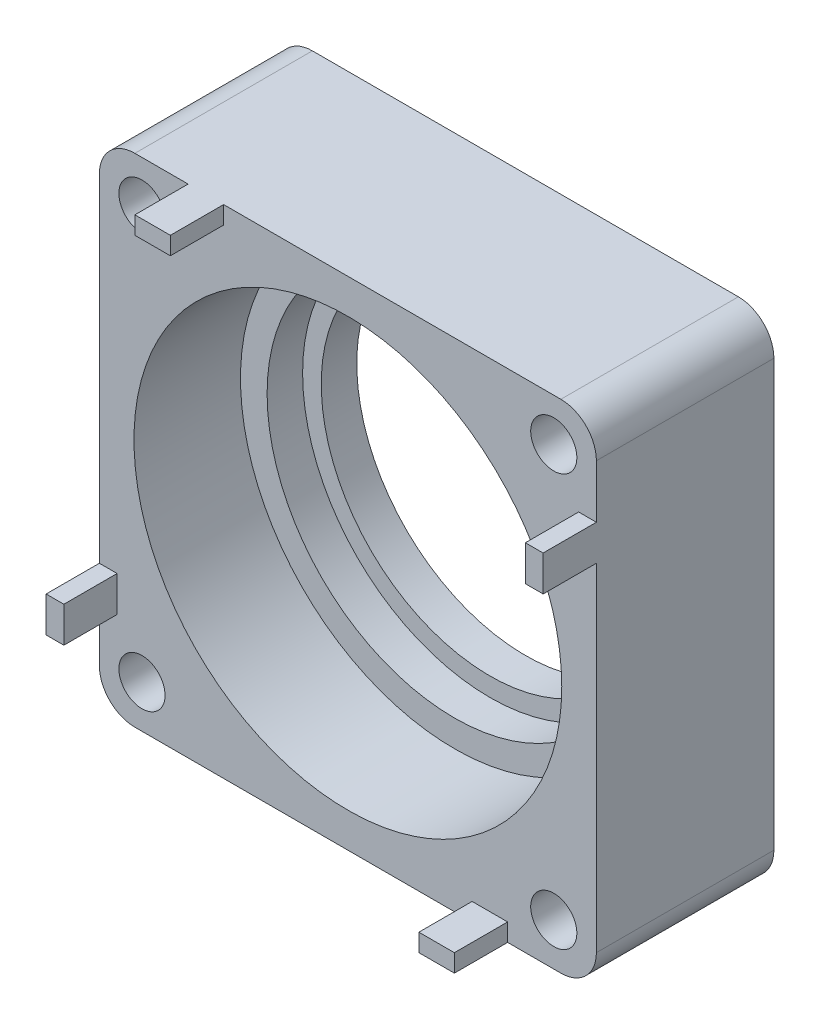
ISO-10303-21;
HEADER;
FILE_DESCRIPTION(('STEP AP214'),'2;1');
FILE_NAME('part.step','',(''),(''),'','','');
FILE_SCHEMA(('AUTOMOTIVE_DESIGN { 1 0 10303 214 1 1 1 1 }'));
ENDSEC;
DATA;
#1=APPLICATION_CONTEXT('core data for automotive mechanical design processes');
#2=APPLICATION_PROTOCOL_DEFINITION('international standard','automotive_design',2000,#1);
#3=PRODUCT_CONTEXT('',#1,'mechanical');
#4=PRODUCT('Part','Part','',(#3));
#5=PRODUCT_RELATED_PRODUCT_CATEGORY('part','',(#4));
#6=PRODUCT_DEFINITION_FORMATION('','',#4);
#7=PRODUCT_DEFINITION_CONTEXT('part definition',#1,'design');
#8=PRODUCT_DEFINITION('design','',#6,#7);
#9=PRODUCT_DEFINITION_SHAPE('','',#8);
#10=(LENGTH_UNIT() NAMED_UNIT(*) SI_UNIT(.MILLI.,.METRE.));
#11=(NAMED_UNIT(*) PLANE_ANGLE_UNIT() SI_UNIT($,.RADIAN.));
#12=(NAMED_UNIT(*) SI_UNIT($,.STERADIAN.) SOLID_ANGLE_UNIT());
#13=UNCERTAINTY_MEASURE_WITH_UNIT(LENGTH_MEASURE(1.E-05),#10,'distance_accuracy_value','');
#14=(GEOMETRIC_REPRESENTATION_CONTEXT(3) GLOBAL_UNCERTAINTY_ASSIGNED_CONTEXT((#13)) GLOBAL_UNIT_ASSIGNED_CONTEXT((#10,
#11,#12)) REPRESENTATION_CONTEXT('',''));
#15=CARTESIAN_POINT('',(0.,0.,0.));
#16=DIRECTION('',(0.,0.,1.));
#17=DIRECTION('',(1.,0.,0.));
#18=AXIS2_PLACEMENT_3D('',#15,#16,#17);
#19=CARTESIAN_POINT('',(0.,0.,10.));
#20=DIRECTION('',(0.,0.,1.));
#21=DIRECTION('',(1.,0.,0.));
#22=AXIS2_PLACEMENT_3D('',#19,#20,#21);
#23=PLANE('',#22);
#24=CARTESIAN_POINT('',(-11.5999999999993,-11.6,10.));
#25=DIRECTION('',(0.,0.,1.));
#26=DIRECTION('',(1.,0.,0.));
#27=AXIS2_PLACEMENT_3D('',#24,#25,#26);
#28=CIRCLE('',#27,1.30000000000034);
#29=CARTESIAN_POINT('',(-10.299999999999,-11.6,10.));
#30=VERTEX_POINT('',#29);
#31=EDGE_CURVE('E331',#30,#30,#28,.T.);
#32=ORIENTED_EDGE('',*,*,#31,.F.);
#33=EDGE_LOOP('',(#32));
#34=FACE_BOUND('',#33,.T.);
#35=CARTESIAN_POINT('',(11.6000000000007,-11.5999999999993,10.));
#36=DIRECTION('',(0.,0.,1.));
#37=DIRECTION('',(1.,0.,0.));
#38=AXIS2_PLACEMENT_3D('',#35,#36,#37);
#39=CIRCLE('',#38,1.30000000000092);
#40=CARTESIAN_POINT('',(12.9000000000016,-11.5999999999993,10.));
#41=VERTEX_POINT('',#40);
#42=EDGE_CURVE('E325',#41,#41,#39,.T.);
#43=ORIENTED_EDGE('',*,*,#42,.F.);
#44=EDGE_LOOP('',(#43));
#45=FACE_BOUND('',#44,.T.);
#46=CARTESIAN_POINT('',(11.6,11.6000000000007,10.));
#47=DIRECTION('',(0.,0.,1.));
#48=DIRECTION('',(1.,0.,0.));
#49=AXIS2_PLACEMENT_3D('',#46,#47,#48);
#50=CIRCLE('',#49,1.30000000000068);
#51=CARTESIAN_POINT('',(12.9000000000007,11.6000000000007,10.));
#52=VERTEX_POINT('',#51);
#53=EDGE_CURVE('E318',#52,#52,#50,.T.);
#54=ORIENTED_EDGE('',*,*,#53,.F.);
#55=EDGE_LOOP('',(#54));
#56=FACE_BOUND('',#55,.T.);
#57=CARTESIAN_POINT('',(-11.6,11.6,10.));
#58=DIRECTION('',(0.,0.,1.));
#59=DIRECTION('',(1.,0.,0.));
#60=AXIS2_PLACEMENT_3D('',#57,#58,#59);
#61=CIRCLE('',#60,1.3);
#62=CARTESIAN_POINT('',(-10.3,11.6,10.));
#63=VERTEX_POINT('',#62);
#64=EDGE_CURVE('E321',#63,#63,#61,.T.);
#65=ORIENTED_EDGE('',*,*,#64,.F.);
#66=EDGE_LOOP('',(#65));
#67=FACE_BOUND('',#66,.T.);
#68=CARTESIAN_POINT('',(0.,0.,10.));
#69=DIRECTION('',(0.,0.,1.));
#70=DIRECTION('',(1.,0.,0.));
#71=AXIS2_PLACEMENT_3D('',#68,#69,#70);
#72=CIRCLE('',#71,12.05);
#73=CARTESIAN_POINT('',(12.05,0.,10.));
#74=VERTEX_POINT('',#73);
#75=EDGE_CURVE('E339',#74,#74,#72,.T.);
#76=ORIENTED_EDGE('',*,*,#75,.F.);
#77=EDGE_LOOP('',(#76));
#78=FACE_BOUND('',#77,.T.);
#79=DIRECTION('',(-1.,0.,0.));
#80=VECTOR('',#79,1.);
#81=CARTESIAN_POINT('',(6.99999999999987,-13.0000000000001,10.));
#82=LINE('',#81,#80);
#83=CARTESIAN_POINT('',(8.99999999999986,-13.0000000000001,10.));
#84=VERTEX_POINT('',#83);
#85=CARTESIAN_POINT('',(6.99999999999987,-13.0000000000001,10.));
#86=VERTEX_POINT('',#85);
#87=EDGE_CURVE('E57',#84,#86,#82,.T.);
#88=ORIENTED_EDGE('',*,*,#87,.F.);
#89=DIRECTION('',(0.,1.,0.));
#90=VECTOR('',#89,1.);
#91=CARTESIAN_POINT('',(8.99999999999986,-14.0000000000001,10.));
#92=LINE('',#91,#90);
#93=CARTESIAN_POINT('',(8.99999999999986,-14.0000000000001,10.));
#94=VERTEX_POINT('',#93);
#95=EDGE_CURVE('E459',#94,#84,#92,.T.);
#96=ORIENTED_EDGE('',*,*,#95,.F.);
#97=DIRECTION('',(1.,0.,0.));
#98=VECTOR('',#97,1.);
#99=CARTESIAN_POINT('',(-14.,-14.,10.));
#100=LINE('',#99,#98);
#101=CARTESIAN_POINT('',(12.,-14.,10.));
#102=VERTEX_POINT('',#101);
#103=EDGE_CURVE('E225',#94,#102,#100,.T.);
#104=ORIENTED_EDGE('',*,*,#103,.T.);
#105=CARTESIAN_POINT('',(12.,-12.,10.));
#106=DIRECTION('',(0.,0.,1.));
#107=DIRECTION('',(1.,0.,0.));
#108=AXIS2_PLACEMENT_3D('',#105,#106,#107);
#109=CIRCLE('',#108,2.);
#110=CARTESIAN_POINT('',(14.,-12.,10.));
#111=VERTEX_POINT('',#110);
#112=EDGE_CURVE('E406',#102,#111,#109,.T.);
#113=ORIENTED_EDGE('',*,*,#112,.T.);
#114=DIRECTION('',(0.,1.,0.));
#115=VECTOR('',#114,1.);
#116=CARTESIAN_POINT('',(14.,14.,10.));
#117=LINE('',#116,#115);
#118=CARTESIAN_POINT('',(14.,7.,10.));
#119=VERTEX_POINT('',#118);
#120=EDGE_CURVE('E356',#111,#119,#117,.T.);
#121=ORIENTED_EDGE('',*,*,#120,.T.);
#122=DIRECTION('',(1.,0.,0.));
#123=VECTOR('',#122,1.);
#124=CARTESIAN_POINT('',(14.,7.,10.));
#125=LINE('',#124,#123);
#126=CARTESIAN_POINT('',(13.,7.,10.));
#127=VERTEX_POINT('',#126);
#128=EDGE_CURVE('E239',#127,#119,#125,.T.);
#129=ORIENTED_EDGE('',*,*,#128,.F.);
#130=DIRECTION('',(0.,-1.,0.));
#131=VECTOR('',#130,1.);
#132=CARTESIAN_POINT('',(13.,7.,10.));
#133=LINE('',#132,#131);
#134=CARTESIAN_POINT('',(13.,9.,10.));
#135=VERTEX_POINT('',#134);
#136=EDGE_CURVE('E229',#135,#127,#133,.T.);
#137=ORIENTED_EDGE('',*,*,#136,.F.);
#138=DIRECTION('',(-1.,0.,0.));
#139=VECTOR('',#138,1.);
#140=CARTESIAN_POINT('',(14.,9.,10.));
#141=LINE('',#140,#139);
#142=CARTESIAN_POINT('',(14.,9.,10.));
#143=VERTEX_POINT('',#142);
#144=EDGE_CURVE('E226',#143,#135,#141,.T.);
#145=ORIENTED_EDGE('',*,*,#144,.F.);
#146=CARTESIAN_POINT('',(14.,12.,10.));
#147=VERTEX_POINT('',#146);
#148=EDGE_CURVE('E359',#143,#147,#117,.T.);
#149=ORIENTED_EDGE('',*,*,#148,.T.);
#150=CARTESIAN_POINT('',(12.,12.,10.));
#151=DIRECTION('',(0.,0.,1.));
#152=DIRECTION('',(1.,0.,0.));
#153=AXIS2_PLACEMENT_3D('',#150,#151,#152);
#154=CIRCLE('',#153,2.);
#155=CARTESIAN_POINT('',(12.,14.,10.));
#156=VERTEX_POINT('',#155);
#157=EDGE_CURVE('E404',#147,#156,#154,.T.);
#158=ORIENTED_EDGE('',*,*,#157,.T.);
#159=DIRECTION('',(-1.,0.,0.));
#160=VECTOR('',#159,1.);
#161=CARTESIAN_POINT('',(-14.,14.,10.));
#162=LINE('',#161,#160);
#163=CARTESIAN_POINT('',(-6.99999999999995,14.,10.));
#164=VERTEX_POINT('',#163);
#165=EDGE_CURVE('E360',#156,#164,#162,.T.);
#166=ORIENTED_EDGE('',*,*,#165,.T.);
#167=DIRECTION('',(0.,1.,0.));
#168=VECTOR('',#167,1.);
#169=CARTESIAN_POINT('',(-6.99999999999995,14.,10.));
#170=LINE('',#169,#168);
#171=CARTESIAN_POINT('',(-6.99999999999996,13.,10.));
#172=VERTEX_POINT('',#171);
#173=EDGE_CURVE('E266',#172,#164,#170,.T.);
#174=ORIENTED_EDGE('',*,*,#173,.F.);
#175=DIRECTION('',(1.,0.,0.));
#176=VECTOR('',#175,1.);
#177=CARTESIAN_POINT('',(-6.99999999999996,13.,10.));
#178=LINE('',#177,#176);
#179=CARTESIAN_POINT('',(-8.99999999999996,13.,10.));
#180=VERTEX_POINT('',#179);
#181=EDGE_CURVE('E274',#180,#172,#178,.T.);
#182=ORIENTED_EDGE('',*,*,#181,.F.);
#183=DIRECTION('',(0.,-1.,0.));
#184=VECTOR('',#183,1.);
#185=CARTESIAN_POINT('',(-8.99999999999995,14.,10.));
#186=LINE('',#185,#184);
#187=CARTESIAN_POINT('',(-8.99999999999995,14.,10.));
#188=VERTEX_POINT('',#187);
#189=EDGE_CURVE('E261',#188,#180,#186,.T.);
#190=ORIENTED_EDGE('',*,*,#189,.F.);
#191=CARTESIAN_POINT('',(-12.,14.,10.));
#192=VERTEX_POINT('',#191);
#193=EDGE_CURVE('E358',#188,#192,#162,.T.);
#194=ORIENTED_EDGE('',*,*,#193,.T.);
#195=CARTESIAN_POINT('',(-12.,12.,10.));
#196=DIRECTION('',(0.,0.,1.));
#197=DIRECTION('',(1.,0.,0.));
#198=AXIS2_PLACEMENT_3D('',#195,#196,#197);
#199=CIRCLE('',#198,2.);
#200=CARTESIAN_POINT('',(-14.,12.,10.));
#201=VERTEX_POINT('',#200);
#202=EDGE_CURVE('E402',#192,#201,#199,.T.);
#203=ORIENTED_EDGE('',*,*,#202,.T.);
#204=DIRECTION('',(0.,-1.,0.));
#205=VECTOR('',#204,1.);
#206=CARTESIAN_POINT('',(-14.,14.,10.));
#207=LINE('',#206,#205);
#208=CARTESIAN_POINT('',(-14.,-7.,10.));
#209=VERTEX_POINT('',#208);
#210=EDGE_CURVE('E364',#201,#209,#207,.T.);
#211=ORIENTED_EDGE('',*,*,#210,.T.);
#212=DIRECTION('',(-1.,0.,0.));
#213=VECTOR('',#212,1.);
#214=CARTESIAN_POINT('',(-14.,-7.,10.));
#215=LINE('',#214,#213);
#216=CARTESIAN_POINT('',(-13.,-7.,10.));
#217=VERTEX_POINT('',#216);
#218=EDGE_CURVE('E292',#217,#209,#215,.T.);
#219=ORIENTED_EDGE('',*,*,#218,.F.);
#220=DIRECTION('',(0.,1.,0.));
#221=VECTOR('',#220,1.);
#222=CARTESIAN_POINT('',(-13.,-7.,10.));
#223=LINE('',#222,#221);
#224=CARTESIAN_POINT('',(-13.,-9.,10.));
#225=VERTEX_POINT('',#224);
#226=EDGE_CURVE('E301',#225,#217,#223,.T.);
#227=ORIENTED_EDGE('',*,*,#226,.F.);
#228=DIRECTION('',(1.,0.,0.));
#229=VECTOR('',#228,1.);
#230=CARTESIAN_POINT('',(-14.,-9.,10.));
#231=LINE('',#230,#229);
#232=CARTESIAN_POINT('',(-14.,-9.,10.));
#233=VERTEX_POINT('',#232);
#234=EDGE_CURVE('E287',#233,#225,#231,.T.);
#235=ORIENTED_EDGE('',*,*,#234,.F.);
#236=CARTESIAN_POINT('',(-14.,-12.,10.));
#237=VERTEX_POINT('',#236);
#238=EDGE_CURVE('E363',#233,#237,#207,.T.);
#239=ORIENTED_EDGE('',*,*,#238,.T.);
#240=CARTESIAN_POINT('',(-12.,-12.,10.));
#241=DIRECTION('',(0.,0.,1.));
#242=DIRECTION('',(1.,0.,0.));
#243=AXIS2_PLACEMENT_3D('',#240,#241,#242);
#244=CIRCLE('',#243,2.);
#245=CARTESIAN_POINT('',(-12.,-14.,10.));
#246=VERTEX_POINT('',#245);
#247=EDGE_CURVE('E408',#237,#246,#244,.T.);
#248=ORIENTED_EDGE('',*,*,#247,.T.);
#249=CARTESIAN_POINT('',(6.99999999999985,-14.,10.));
#250=VERTEX_POINT('',#249);
#251=EDGE_CURVE('E366',#246,#250,#100,.T.);
#252=ORIENTED_EDGE('',*,*,#251,.T.);
#253=DIRECTION('',(0.,-1.,0.));
#254=VECTOR('',#253,1.);
#255=CARTESIAN_POINT('',(6.99999999999986,-14.0000000000001,10.));
#256=LINE('',#255,#254);
#257=EDGE_CURVE('E62',#86,#250,#256,.T.);
#258=ORIENTED_EDGE('',*,*,#257,.F.);
#259=EDGE_LOOP('',(#88,#96,#104,#113,#121,#129,#137,#145,#149,#158,#166,#174,#182,#190,#194,
#203,#211,#219,#227,#235,#239,#248,#252,#258));
#260=FACE_BOUND('',#259,.T.);
#261=ADVANCED_FACE('F42',(#34,#45,#56,#67,#78,#260),#23,.T.);
#262=CARTESIAN_POINT('',(0.,0.,-29.8399061660723));
#263=DIRECTION('',(0.,0.,1.));
#264=DIRECTION('',(1.,0.,0.));
#265=AXIS2_PLACEMENT_3D('',#262,#263,#264);
#266=CYLINDRICAL_SURFACE('',#265,10.55);
#267=CARTESIAN_POINT('',(0.,0.,2.));
#268=DIRECTION('',(0.,0.,1.));
#269=DIRECTION('',(1.,0.,0.));
#270=AXIS2_PLACEMENT_3D('',#267,#268,#269);
#271=CIRCLE('',#270,10.55);
#272=CARTESIAN_POINT('',(10.55,0.,2.));
#273=VERTEX_POINT('',#272);
#274=EDGE_CURVE('E348',#273,#273,#271,.F.);
#275=ORIENTED_EDGE('',*,*,#274,.T.);
#276=EDGE_LOOP('',(#275));
#277=FACE_BOUND('',#276,.T.);
#278=CARTESIAN_POINT('',(0.,0.,4.));
#279=DIRECTION('',(0.,0.,1.));
#280=DIRECTION('',(1.,0.,0.));
#281=AXIS2_PLACEMENT_3D('',#278,#279,#280);
#282=CIRCLE('',#281,10.55);
#283=CARTESIAN_POINT('',(10.55,0.,4.));
#284=VERTEX_POINT('',#283);
#285=EDGE_CURVE('E347',#284,#284,#282,.F.);
#286=ORIENTED_EDGE('',*,*,#285,.F.);
#287=EDGE_LOOP('',(#286));
#288=FACE_BOUND('',#287,.T.);
#289=ADVANCED_FACE('F474',(#277,#288),#266,.F.);
#290=CARTESIAN_POINT('',(0.,0.,0.));
#291=DIRECTION('',(0.,0.,1.));
#292=DIRECTION('',(1.,0.,0.));
#293=AXIS2_PLACEMENT_3D('',#290,#291,#292);
#294=CYLINDRICAL_SURFACE('',#293,9.5);
#295=CARTESIAN_POINT('',(0.,0.,0.));
#296=DIRECTION('',(0.,0.,1.));
#297=DIRECTION('',(1.,0.,0.));
#298=AXIS2_PLACEMENT_3D('',#295,#296,#297);
#299=CIRCLE('',#298,9.5);
#300=CARTESIAN_POINT('',(9.5,0.,0.));
#301=VERTEX_POINT('',#300);
#302=EDGE_CURVE('E352',#301,#301,#299,.T.);
#303=ORIENTED_EDGE('',*,*,#302,.F.);
#304=EDGE_LOOP('',(#303));
#305=FACE_BOUND('',#304,.T.);
#306=CARTESIAN_POINT('',(0.,0.,2.));
#307=DIRECTION('',(0.,0.,1.));
#308=DIRECTION('',(1.,0.,0.));
#309=AXIS2_PLACEMENT_3D('',#306,#307,#308);
#310=CIRCLE('',#309,9.5);
#311=CARTESIAN_POINT('',(9.5,0.,2.));
#312=VERTEX_POINT('',#311);
#313=EDGE_CURVE('E351',#312,#312,#310,.F.);
#314=ORIENTED_EDGE('',*,*,#313,.F.);
#315=EDGE_LOOP('',(#314));
#316=FACE_BOUND('',#315,.T.);
#317=ADVANCED_FACE('F480',(#305,#316),#294,.F.);
#318=CARTESIAN_POINT('',(14.,14.,10.));
#319=DIRECTION('',(-1.,0.,0.));
#320=DIRECTION('',(0.,0.,1.));
#321=AXIS2_PLACEMENT_3D('',#318,#319,#320);
#322=PLANE('',#321);
#323=ORIENTED_EDGE('',*,*,#120,.F.);
#324=DIRECTION('',(0.,0.,-1.));
#325=VECTOR('',#324,1.);
#326=CARTESIAN_POINT('',(14.,-12.,10.));
#327=LINE('',#326,#325);
#328=CARTESIAN_POINT('',(14.,-12.,0.));
#329=VERTEX_POINT('',#328);
#330=EDGE_CURVE('E413',#111,#329,#327,.T.);
#331=ORIENTED_EDGE('',*,*,#330,.T.);
#332=DIRECTION('',(0.,1.,0.));
#333=VECTOR('',#332,1.);
#334=CARTESIAN_POINT('',(14.,14.,0.));
#335=LINE('',#334,#333);
#336=CARTESIAN_POINT('',(14.,12.,0.));
#337=VERTEX_POINT('',#336);
#338=EDGE_CURVE('E355',#329,#337,#335,.T.);
#339=ORIENTED_EDGE('',*,*,#338,.T.);
#340=DIRECTION('',(0.,0.,-1.));
#341=VECTOR('',#340,1.);
#342=CARTESIAN_POINT('',(14.,12.,10.));
#343=LINE('',#342,#341);
#344=EDGE_CURVE('E410',#337,#147,#343,.F.);
#345=ORIENTED_EDGE('',*,*,#344,.T.);
#346=ORIENTED_EDGE('',*,*,#148,.F.);
#347=DIRECTION('',(0.,0.,-1.));
#348=VECTOR('',#347,1.);
#349=CARTESIAN_POINT('',(14.,9.,13.));
#350=LINE('',#349,#348);
#351=CARTESIAN_POINT('',(14.,9.,13.));
#352=VERTEX_POINT('',#351);
#353=EDGE_CURVE('E258',#352,#143,#350,.T.);
#354=ORIENTED_EDGE('',*,*,#353,.F.);
#355=DIRECTION('',(0.,1.,0.));
#356=VECTOR('',#355,1.);
#357=CARTESIAN_POINT('',(14.,7.,13.));
#358=LINE('',#357,#356);
#359=CARTESIAN_POINT('',(14.,7.,13.));
#360=VERTEX_POINT('',#359);
#361=EDGE_CURVE('E235',#360,#352,#358,.T.);
#362=ORIENTED_EDGE('',*,*,#361,.F.);
#363=DIRECTION('',(0.,0.,-1.));
#364=VECTOR('',#363,1.);
#365=CARTESIAN_POINT('',(14.,7.,13.));
#366=LINE('',#365,#364);
#367=EDGE_CURVE('E244',#360,#119,#366,.T.);
#368=ORIENTED_EDGE('',*,*,#367,.T.);
#369=EDGE_LOOP('',(#323,#331,#339,#345,#346,#354,#362,#368));
#370=FACE_BOUND('',#369,.T.);
#371=ADVANCED_FACE('F498',(#370),#322,.F.);
#372=CARTESIAN_POINT('',(-14.,14.,10.));
#373=DIRECTION('',(0.,-1.,0.));
#374=DIRECTION('',(0.,0.,-1.));
#375=AXIS2_PLACEMENT_3D('',#372,#373,#374);
#376=PLANE('',#375);
#377=ORIENTED_EDGE('',*,*,#165,.F.);
#378=DIRECTION('',(0.,0.,-1.));
#379=VECTOR('',#378,1.);
#380=CARTESIAN_POINT('',(12.,14.,10.));
#381=LINE('',#380,#379);
#382=CARTESIAN_POINT('',(12.,14.,0.));
#383=VERTEX_POINT('',#382);
#384=EDGE_CURVE('E13',#156,#383,#381,.T.);
#385=ORIENTED_EDGE('',*,*,#384,.T.);
#386=DIRECTION('',(-1.,0.,0.));
#387=VECTOR('',#386,1.);
#388=CARTESIAN_POINT('',(-14.,14.,0.));
#389=LINE('',#388,#387);
#390=CARTESIAN_POINT('',(-12.,14.,0.));
#391=VERTEX_POINT('',#390);
#392=EDGE_CURVE('E371',#383,#391,#389,.T.);
#393=ORIENTED_EDGE('',*,*,#392,.T.);
#394=DIRECTION('',(0.,0.,-1.));
#395=VECTOR('',#394,1.);
#396=CARTESIAN_POINT('',(-12.,14.,10.));
#397=LINE('',#396,#395);
#398=EDGE_CURVE('E50',#391,#192,#397,.F.);
#399=ORIENTED_EDGE('',*,*,#398,.T.);
#400=ORIENTED_EDGE('',*,*,#193,.F.);
#401=DIRECTION('',(0.,0.,-1.));
#402=VECTOR('',#401,1.);
#403=CARTESIAN_POINT('',(-8.99999999999995,14.,13.));
#404=LINE('',#403,#402);
#405=CARTESIAN_POINT('',(-8.99999999999995,14.,13.));
#406=VERTEX_POINT('',#405);
#407=EDGE_CURVE('E285',#406,#188,#404,.T.);
#408=ORIENTED_EDGE('',*,*,#407,.F.);
#409=DIRECTION('',(-1.,0.,0.));
#410=VECTOR('',#409,1.);
#411=CARTESIAN_POINT('',(-6.99999999999995,14.,13.));
#412=LINE('',#411,#410);
#413=CARTESIAN_POINT('',(-6.99999999999995,14.,13.));
#414=VERTEX_POINT('',#413);
#415=EDGE_CURVE('E262',#414,#406,#412,.T.);
#416=ORIENTED_EDGE('',*,*,#415,.F.);
#417=DIRECTION('',(0.,0.,-1.));
#418=VECTOR('',#417,1.);
#419=CARTESIAN_POINT('',(-6.99999999999995,14.,13.));
#420=LINE('',#419,#418);
#421=EDGE_CURVE('E272',#414,#164,#420,.T.);
#422=ORIENTED_EDGE('',*,*,#421,.T.);
#423=EDGE_LOOP('',(#377,#385,#393,#399,#400,#408,#416,#422));
#424=FACE_BOUND('',#423,.T.);
#425=ADVANCED_FACE('F421',(#424),#376,.F.);
#426=CARTESIAN_POINT('',(-14.,14.,10.));
#427=DIRECTION('',(1.,0.,0.));
#428=DIRECTION('',(0.,0.,-1.));
#429=AXIS2_PLACEMENT_3D('',#426,#427,#428);
#430=PLANE('',#429);
#431=DIRECTION('',(0.,-1.,0.));
#432=VECTOR('',#431,1.);
#433=CARTESIAN_POINT('',(-14.,14.,0.));
#434=LINE('',#433,#432);
#435=CARTESIAN_POINT('',(-14.,12.,0.));
#436=VERTEX_POINT('',#435);
#437=CARTESIAN_POINT('',(-14.,-12.,0.));
#438=VERTEX_POINT('',#437);
#439=EDGE_CURVE('E374',#436,#438,#434,.T.);
#440=ORIENTED_EDGE('',*,*,#439,.T.);
#441=DIRECTION('',(0.,0.,-1.));
#442=VECTOR('',#441,1.);
#443=CARTESIAN_POINT('',(-14.,-12.,10.));
#444=LINE('',#443,#442);
#445=EDGE_CURVE('E399',#438,#237,#444,.F.);
#446=ORIENTED_EDGE('',*,*,#445,.T.);
#447=ORIENTED_EDGE('',*,*,#238,.F.);
#448=DIRECTION('',(0.,0.,-1.));
#449=VECTOR('',#448,1.);
#450=CARTESIAN_POINT('',(-14.,-9.,13.));
#451=LINE('',#450,#449);
#452=CARTESIAN_POINT('',(-14.,-9.,13.));
#453=VERTEX_POINT('',#452);
#454=EDGE_CURVE('E314',#453,#233,#451,.T.);
#455=ORIENTED_EDGE('',*,*,#454,.F.);
#456=DIRECTION('',(0.,-1.,0.));
#457=VECTOR('',#456,1.);
#458=CARTESIAN_POINT('',(-14.,-7.,13.));
#459=LINE('',#458,#457);
#460=CARTESIAN_POINT('',(-14.,-7.,13.));
#461=VERTEX_POINT('',#460);
#462=EDGE_CURVE('E288',#461,#453,#459,.T.);
#463=ORIENTED_EDGE('',*,*,#462,.F.);
#464=DIRECTION('',(0.,0.,-1.));
#465=VECTOR('',#464,1.);
#466=CARTESIAN_POINT('',(-14.,-7.,13.));
#467=LINE('',#466,#465);
#468=EDGE_CURVE('E298',#461,#209,#467,.T.);
#469=ORIENTED_EDGE('',*,*,#468,.T.);
#470=ORIENTED_EDGE('',*,*,#210,.F.);
#471=DIRECTION('',(0.,0.,-1.));
#472=VECTOR('',#471,1.);
#473=CARTESIAN_POINT('',(-14.,12.,10.));
#474=LINE('',#473,#472);
#475=EDGE_CURVE('E396',#201,#436,#474,.T.);
#476=ORIENTED_EDGE('',*,*,#475,.T.);
#477=EDGE_LOOP('',(#440,#446,#447,#455,#463,#469,#470,#476));
#478=FACE_BOUND('',#477,.T.);
#479=ADVANCED_FACE('F429',(#478),#430,.F.);
#480=CARTESIAN_POINT('',(-14.,-14.,10.));
#481=DIRECTION('',(0.,1.,0.));
#482=DIRECTION('',(0.,0.,1.));
#483=AXIS2_PLACEMENT_3D('',#480,#481,#482);
#484=PLANE('',#483);
#485=ORIENTED_EDGE('',*,*,#251,.F.);
#486=DIRECTION('',(0.,0.,-1.));
#487=VECTOR('',#486,1.);
#488=CARTESIAN_POINT('',(-12.,-14.,10.));
#489=LINE('',#488,#487);
#490=CARTESIAN_POINT('',(-12.,-14.,0.));
#491=VERTEX_POINT('',#490);
#492=EDGE_CURVE('E385',#246,#491,#489,.T.);
#493=ORIENTED_EDGE('',*,*,#492,.T.);
#494=DIRECTION('',(1.,0.,0.));
#495=VECTOR('',#494,1.);
#496=CARTESIAN_POINT('',(-14.,-14.,0.));
#497=LINE('',#496,#495);
#498=CARTESIAN_POINT('',(12.,-14.,0.));
#499=VERTEX_POINT('',#498);
#500=EDGE_CURVE('E377',#491,#499,#497,.T.);
#501=ORIENTED_EDGE('',*,*,#500,.T.);
#502=DIRECTION('',(0.,0.,-1.));
#503=VECTOR('',#502,1.);
#504=CARTESIAN_POINT('',(12.,-14.,10.));
#505=LINE('',#504,#503);
#506=EDGE_CURVE('E368',#499,#102,#505,.F.);
#507=ORIENTED_EDGE('',*,*,#506,.T.);
#508=ORIENTED_EDGE('',*,*,#103,.F.);
#509=DIRECTION('',(0.,0.,-1.));
#510=VECTOR('',#509,1.);
#511=CARTESIAN_POINT('',(8.99999999999986,-14.0000000000001,13.));
#512=LINE('',#511,#510);
#513=CARTESIAN_POINT('',(8.99999999999986,-14.0000000000001,13.));
#514=VERTEX_POINT('',#513);
#515=EDGE_CURVE('E206',#514,#94,#512,.T.);
#516=ORIENTED_EDGE('',*,*,#515,.F.);
#517=DIRECTION('',(1.,0.,0.));
#518=VECTOR('',#517,1.);
#519=CARTESIAN_POINT('',(6.99999999999986,-14.0000000000001,13.));
#520=LINE('',#519,#518);
#521=CARTESIAN_POINT('',(6.99999999999986,-14.0000000000001,13.));
#522=VERTEX_POINT('',#521);
#523=EDGE_CURVE('E212',#522,#514,#520,.T.);
#524=ORIENTED_EDGE('',*,*,#523,.F.);
#525=DIRECTION('',(0.,0.,-1.));
#526=VECTOR('',#525,1.);
#527=CARTESIAN_POINT('',(6.99999999999986,-14.0000000000001,13.));
#528=LINE('',#527,#526);
#529=EDGE_CURVE('E451',#522,#250,#528,.T.);
#530=ORIENTED_EDGE('',*,*,#529,.T.);
#531=EDGE_LOOP('',(#485,#493,#501,#507,#508,#516,#524,#530));
#532=FACE_BOUND('',#531,.T.);
#533=ADVANCED_FACE('F223',(#532),#484,.F.);
#534=CARTESIAN_POINT('',(0.,0.,0.));
#535=DIRECTION('',(0.,0.,1.));
#536=DIRECTION('',(1.,0.,0.));
#537=AXIS2_PLACEMENT_3D('',#534,#535,#536);
#538=PLANE('',#537);
#539=CARTESIAN_POINT('',(-11.5999999999993,-11.6,0.));
#540=DIRECTION('',(0.,0.,1.));
#541=DIRECTION('',(1.,0.,0.));
#542=AXIS2_PLACEMENT_3D('',#539,#540,#541);
#543=CIRCLE('',#542,1.30000000000034);
#544=CARTESIAN_POINT('',(-10.299999999999,-11.6,0.));
#545=VERTEX_POINT('',#544);
#546=EDGE_CURVE('E317',#545,#545,#543,.T.);
#547=ORIENTED_EDGE('',*,*,#546,.T.);
#548=EDGE_LOOP('',(#547));
#549=FACE_BOUND('',#548,.T.);
#550=CARTESIAN_POINT('',(11.6000000000007,-11.5999999999993,0.));
#551=DIRECTION('',(0.,0.,1.));
#552=DIRECTION('',(1.,0.,0.));
#553=AXIS2_PLACEMENT_3D('',#550,#551,#552);
#554=CIRCLE('',#553,1.30000000000092);
#555=CARTESIAN_POINT('',(12.9000000000016,-11.5999999999993,0.));
#556=VERTEX_POINT('',#555);
#557=EDGE_CURVE('E328',#556,#556,#554,.T.);
#558=ORIENTED_EDGE('',*,*,#557,.T.);
#559=EDGE_LOOP('',(#558));
#560=FACE_BOUND('',#559,.T.);
#561=CARTESIAN_POINT('',(11.6,11.6000000000007,0.));
#562=DIRECTION('',(0.,0.,1.));
#563=DIRECTION('',(1.,0.,0.));
#564=AXIS2_PLACEMENT_3D('',#561,#562,#563);
#565=CIRCLE('',#564,1.30000000000068);
#566=CARTESIAN_POINT('',(12.9000000000007,11.6000000000007,0.));
#567=VERTEX_POINT('',#566);
#568=EDGE_CURVE('E322',#567,#567,#565,.T.);
#569=ORIENTED_EDGE('',*,*,#568,.T.);
#570=EDGE_LOOP('',(#569));
#571=FACE_BOUND('',#570,.T.);
#572=CARTESIAN_POINT('',(-11.6,11.6,0.));
#573=DIRECTION('',(0.,0.,1.));
#574=DIRECTION('',(1.,0.,0.));
#575=AXIS2_PLACEMENT_3D('',#572,#573,#574);
#576=CIRCLE('',#575,1.3);
#577=CARTESIAN_POINT('',(-10.3,11.6,0.));
#578=VERTEX_POINT('',#577);
#579=EDGE_CURVE('E336',#578,#578,#576,.T.);
#580=ORIENTED_EDGE('',*,*,#579,.T.);
#581=EDGE_LOOP('',(#580));
#582=FACE_BOUND('',#581,.T.);
#583=ORIENTED_EDGE('',*,*,#302,.T.);
#584=EDGE_LOOP('',(#583));
#585=FACE_BOUND('',#584,.T.);
#586=ORIENTED_EDGE('',*,*,#500,.F.);
#587=CARTESIAN_POINT('',(-12.,-12.,0.));
#588=DIRECTION('',(0.,0.,1.));
#589=DIRECTION('',(1.,0.,0.));
#590=AXIS2_PLACEMENT_3D('',#587,#588,#589);
#591=CIRCLE('',#590,2.);
#592=EDGE_CURVE('E394',#491,#438,#591,.F.);
#593=ORIENTED_EDGE('',*,*,#592,.T.);
#594=ORIENTED_EDGE('',*,*,#439,.F.);
#595=CARTESIAN_POINT('',(-12.,12.,0.));
#596=DIRECTION('',(0.,0.,1.));
#597=DIRECTION('',(1.,0.,0.));
#598=AXIS2_PLACEMENT_3D('',#595,#596,#597);
#599=CIRCLE('',#598,2.);
#600=EDGE_CURVE('E388',#436,#391,#599,.F.);
#601=ORIENTED_EDGE('',*,*,#600,.T.);
#602=ORIENTED_EDGE('',*,*,#392,.F.);
#603=CARTESIAN_POINT('',(12.,12.,0.));
#604=DIRECTION('',(0.,0.,1.));
#605=DIRECTION('',(1.,0.,0.));
#606=AXIS2_PLACEMENT_3D('',#603,#604,#605);
#607=CIRCLE('',#606,2.);
#608=EDGE_CURVE('E390',#383,#337,#607,.F.);
#609=ORIENTED_EDGE('',*,*,#608,.T.);
#610=ORIENTED_EDGE('',*,*,#338,.F.);
#611=CARTESIAN_POINT('',(12.,-12.,0.));
#612=DIRECTION('',(0.,0.,1.));
#613=DIRECTION('',(1.,0.,0.));
#614=AXIS2_PLACEMENT_3D('',#611,#612,#613);
#615=CIRCLE('',#614,2.);
#616=EDGE_CURVE('E392',#329,#499,#615,.F.);
#617=ORIENTED_EDGE('',*,*,#616,.T.);
#618=EDGE_LOOP('',(#586,#593,#594,#601,#602,#609,#610,#617));
#619=FACE_BOUND('',#618,.T.);
#620=ADVANCED_FACE('F487',(#549,#560,#571,#582,#585,#619),#538,.F.);
#621=CARTESIAN_POINT('',(0.,0.,2.));
#622=DIRECTION('',(0.,0.,1.));
#623=DIRECTION('',(1.,0.,0.));
#624=AXIS2_PLACEMENT_3D('',#621,#622,#623);
#625=PLANE('',#624);
#626=ORIENTED_EDGE('',*,*,#274,.F.);
#627=EDGE_LOOP('',(#626));
#628=FACE_BOUND('',#627,.T.);
#629=ORIENTED_EDGE('',*,*,#313,.T.);
#630=EDGE_LOOP('',(#629));
#631=FACE_BOUND('',#630,.T.);
#632=ADVANCED_FACE('F490',(#628,#631),#625,.T.);
#633=CARTESIAN_POINT('',(0.,0.,4.));
#634=DIRECTION('',(0.,0.,1.));
#635=DIRECTION('',(1.,0.,0.));
#636=AXIS2_PLACEMENT_3D('',#633,#634,#635);
#637=PLANE('',#636);
#638=CARTESIAN_POINT('',(0.,0.,4.));
#639=DIRECTION('',(0.,0.,1.));
#640=DIRECTION('',(1.,0.,0.));
#641=AXIS2_PLACEMENT_3D('',#638,#639,#640);
#642=CIRCLE('',#641,12.05);
#643=CARTESIAN_POINT('',(12.05,0.,4.));
#644=VERTEX_POINT('',#643);
#645=EDGE_CURVE('E344',#644,#644,#642,.F.);
#646=ORIENTED_EDGE('',*,*,#645,.F.);
#647=EDGE_LOOP('',(#646));
#648=FACE_BOUND('',#647,.T.);
#649=ORIENTED_EDGE('',*,*,#285,.T.);
#650=EDGE_LOOP('',(#649));
#651=FACE_BOUND('',#650,.T.);
#652=ADVANCED_FACE('F577',(#648,#651),#637,.T.);
#653=CARTESIAN_POINT('',(0.,0.,-32.0825468531916));
#654=DIRECTION('',(0.,0.,1.));
#655=DIRECTION('',(1.,0.,0.));
#656=AXIS2_PLACEMENT_3D('',#653,#654,#655);
#657=CYLINDRICAL_SURFACE('',#656,12.05);
#658=ORIENTED_EDGE('',*,*,#645,.T.);
#659=EDGE_LOOP('',(#658));
#660=FACE_BOUND('',#659,.T.);
#661=ORIENTED_EDGE('',*,*,#75,.T.);
#662=EDGE_LOOP('',(#661));
#663=FACE_BOUND('',#662,.T.);
#664=ADVANCED_FACE('F505',(#660,#663),#657,.F.);
#665=CARTESIAN_POINT('',(-12.,-12.,10.));
#666=DIRECTION('',(0.,0.,-1.));
#667=DIRECTION('',(-1.,0.,0.));
#668=AXIS2_PLACEMENT_3D('',#665,#666,#667);
#669=CYLINDRICAL_SURFACE('',#668,2.);
#670=ORIENTED_EDGE('',*,*,#247,.F.);
#671=ORIENTED_EDGE('',*,*,#445,.F.);
#672=ORIENTED_EDGE('',*,*,#592,.F.);
#673=ORIENTED_EDGE('',*,*,#492,.F.);
#674=EDGE_LOOP('',(#670,#671,#672,#673));
#675=FACE_BOUND('',#674,.T.);
#676=ADVANCED_FACE('F449',(#675),#669,.T.);
#677=CARTESIAN_POINT('',(12.,-12.,10.));
#678=DIRECTION('',(0.,0.,-1.));
#679=DIRECTION('',(-1.,0.,0.));
#680=AXIS2_PLACEMENT_3D('',#677,#678,#679);
#681=CYLINDRICAL_SURFACE('',#680,2.);
#682=ORIENTED_EDGE('',*,*,#112,.F.);
#683=ORIENTED_EDGE('',*,*,#506,.F.);
#684=ORIENTED_EDGE('',*,*,#616,.F.);
#685=ORIENTED_EDGE('',*,*,#330,.F.);
#686=EDGE_LOOP('',(#682,#683,#684,#685));
#687=FACE_BOUND('',#686,.T.);
#688=ADVANCED_FACE('F504',(#687),#681,.T.);
#689=CARTESIAN_POINT('',(12.,12.,10.));
#690=DIRECTION('',(0.,0.,-1.));
#691=DIRECTION('',(-1.,0.,0.));
#692=AXIS2_PLACEMENT_3D('',#689,#690,#691);
#693=CYLINDRICAL_SURFACE('',#692,2.);
#694=ORIENTED_EDGE('',*,*,#157,.F.);
#695=ORIENTED_EDGE('',*,*,#344,.F.);
#696=ORIENTED_EDGE('',*,*,#608,.F.);
#697=ORIENTED_EDGE('',*,*,#384,.F.);
#698=EDGE_LOOP('',(#694,#695,#696,#697));
#699=FACE_BOUND('',#698,.T.);
#700=ADVANCED_FACE('F507',(#699),#693,.T.);
#701=CARTESIAN_POINT('',(-12.,12.,10.));
#702=DIRECTION('',(0.,0.,-1.));
#703=DIRECTION('',(-1.,0.,0.));
#704=AXIS2_PLACEMENT_3D('',#701,#702,#703);
#705=CYLINDRICAL_SURFACE('',#704,2.);
#706=ORIENTED_EDGE('',*,*,#202,.F.);
#707=ORIENTED_EDGE('',*,*,#398,.F.);
#708=ORIENTED_EDGE('',*,*,#600,.F.);
#709=ORIENTED_EDGE('',*,*,#475,.F.);
#710=EDGE_LOOP('',(#706,#707,#708,#709));
#711=FACE_BOUND('',#710,.T.);
#712=ADVANCED_FACE('F44',(#711),#705,.T.);
#713=CARTESIAN_POINT('',(-11.6,11.6,0.));
#714=DIRECTION('',(0.,0.,1.));
#715=DIRECTION('',(1.,0.,0.));
#716=AXIS2_PLACEMENT_3D('',#713,#714,#715);
#717=CYLINDRICAL_SURFACE('',#716,1.3);
#718=ORIENTED_EDGE('',*,*,#579,.F.);
#719=EDGE_LOOP('',(#718));
#720=FACE_BOUND('',#719,.T.);
#721=ORIENTED_EDGE('',*,*,#64,.T.);
#722=EDGE_LOOP('',(#721));
#723=FACE_BOUND('',#722,.T.);
#724=ADVANCED_FACE('F514',(#720,#723),#717,.F.);
#725=CARTESIAN_POINT('',(11.6,11.6000000000007,0.));
#726=DIRECTION('',(0.,0.,1.));
#727=DIRECTION('',(1.,0.,0.));
#728=AXIS2_PLACEMENT_3D('',#725,#726,#727);
#729=CYLINDRICAL_SURFACE('',#728,1.30000000000068);
#730=ORIENTED_EDGE('',*,*,#568,.F.);
#731=EDGE_LOOP('',(#730));
#732=FACE_BOUND('',#731,.T.);
#733=ORIENTED_EDGE('',*,*,#53,.T.);
#734=EDGE_LOOP('',(#733));
#735=FACE_BOUND('',#734,.T.);
#736=ADVANCED_FACE('F563',(#732,#735),#729,.F.);
#737=CARTESIAN_POINT('',(11.6000000000007,-11.5999999999993,0.));
#738=DIRECTION('',(0.,0.,1.));
#739=DIRECTION('',(1.,0.,0.));
#740=AXIS2_PLACEMENT_3D('',#737,#738,#739);
#741=CYLINDRICAL_SURFACE('',#740,1.30000000000092);
#742=ORIENTED_EDGE('',*,*,#557,.F.);
#743=EDGE_LOOP('',(#742));
#744=FACE_BOUND('',#743,.T.);
#745=ORIENTED_EDGE('',*,*,#42,.T.);
#746=EDGE_LOOP('',(#745));
#747=FACE_BOUND('',#746,.T.);
#748=ADVANCED_FACE('F566',(#744,#747),#741,.F.);
#749=CARTESIAN_POINT('',(-11.5999999999993,-11.6,0.));
#750=DIRECTION('',(0.,0.,1.));
#751=DIRECTION('',(1.,0.,0.));
#752=AXIS2_PLACEMENT_3D('',#749,#750,#751);
#753=CYLINDRICAL_SURFACE('',#752,1.30000000000034);
#754=ORIENTED_EDGE('',*,*,#546,.F.);
#755=EDGE_LOOP('',(#754));
#756=FACE_BOUND('',#755,.T.);
#757=ORIENTED_EDGE('',*,*,#31,.T.);
#758=EDGE_LOOP('',(#757));
#759=FACE_BOUND('',#758,.T.);
#760=ADVANCED_FACE('F562',(#756,#759),#753,.F.);
#761=CARTESIAN_POINT('',(-14.,-9.,13.));
#762=DIRECTION('',(0.,1.,0.));
#763=DIRECTION('',(-1.,0.,0.));
#764=AXIS2_PLACEMENT_3D('',#761,#762,#763);
#765=PLANE('',#764);
#766=ORIENTED_EDGE('',*,*,#234,.T.);
#767=DIRECTION('',(0.,0.,-1.));
#768=VECTOR('',#767,1.);
#769=CARTESIAN_POINT('',(-13.,-9.,13.));
#770=LINE('',#769,#768);
#771=CARTESIAN_POINT('',(-13.,-9.,13.));
#772=VERTEX_POINT('',#771);
#773=EDGE_CURVE('E311',#772,#225,#770,.T.);
#774=ORIENTED_EDGE('',*,*,#773,.F.);
#775=DIRECTION('',(1.,0.,0.));
#776=VECTOR('',#775,1.);
#777=CARTESIAN_POINT('',(-14.,-9.,13.));
#778=LINE('',#777,#776);
#779=EDGE_CURVE('E291',#453,#772,#778,.T.);
#780=ORIENTED_EDGE('',*,*,#779,.F.);
#781=ORIENTED_EDGE('',*,*,#454,.T.);
#782=EDGE_LOOP('',(#766,#774,#780,#781));
#783=FACE_BOUND('',#782,.T.);
#784=ADVANCED_FACE('F443',(#783),#765,.F.);
#785=CARTESIAN_POINT('',(-13.,-7.,13.));
#786=DIRECTION('',(-1.,0.,0.));
#787=DIRECTION('',(0.,-1.,0.));
#788=AXIS2_PLACEMENT_3D('',#785,#786,#787);
#789=PLANE('',#788);
#790=ORIENTED_EDGE('',*,*,#226,.T.);
#791=DIRECTION('',(0.,0.,-1.));
#792=VECTOR('',#791,1.);
#793=CARTESIAN_POINT('',(-13.,-7.,13.));
#794=LINE('',#793,#792);
#795=CARTESIAN_POINT('',(-13.,-7.,13.));
#796=VERTEX_POINT('',#795);
#797=EDGE_CURVE('E308',#796,#217,#794,.T.);
#798=ORIENTED_EDGE('',*,*,#797,.F.);
#799=DIRECTION('',(0.,1.,0.));
#800=VECTOR('',#799,1.);
#801=CARTESIAN_POINT('',(-13.,-7.,13.));
#802=LINE('',#801,#800);
#803=EDGE_CURVE('E294',#772,#796,#802,.T.);
#804=ORIENTED_EDGE('',*,*,#803,.F.);
#805=ORIENTED_EDGE('',*,*,#773,.T.);
#806=EDGE_LOOP('',(#790,#798,#804,#805));
#807=FACE_BOUND('',#806,.T.);
#808=ADVANCED_FACE('F439',(#807),#789,.F.);
#809=CARTESIAN_POINT('',(-14.,-7.,13.));
#810=DIRECTION('',(0.,-1.,0.));
#811=DIRECTION('',(0.,0.,-1.));
#812=AXIS2_PLACEMENT_3D('',#809,#810,#811);
#813=PLANE('',#812);
#814=ORIENTED_EDGE('',*,*,#218,.T.);
#815=ORIENTED_EDGE('',*,*,#468,.F.);
#816=DIRECTION('',(-1.,0.,0.));
#817=VECTOR('',#816,1.);
#818=CARTESIAN_POINT('',(-14.,-7.,13.));
#819=LINE('',#818,#817);
#820=EDGE_CURVE('E296',#796,#461,#819,.T.);
#821=ORIENTED_EDGE('',*,*,#820,.F.);
#822=ORIENTED_EDGE('',*,*,#797,.T.);
#823=EDGE_LOOP('',(#814,#815,#821,#822));
#824=FACE_BOUND('',#823,.T.);
#825=ADVANCED_FACE('F436',(#824),#813,.F.);
#826=CARTESIAN_POINT('',(0.,0.,13.));
#827=DIRECTION('',(0.,0.,1.));
#828=DIRECTION('',(1.,0.,0.));
#829=AXIS2_PLACEMENT_3D('',#826,#827,#828);
#830=PLANE('',#829);
#831=ORIENTED_EDGE('',*,*,#462,.T.);
#832=ORIENTED_EDGE('',*,*,#779,.T.);
#833=ORIENTED_EDGE('',*,*,#803,.T.);
#834=ORIENTED_EDGE('',*,*,#820,.T.);
#835=EDGE_LOOP('',(#831,#832,#833,#834));
#836=FACE_BOUND('',#835,.T.);
#837=ADVANCED_FACE('F552',(#836),#830,.T.);
#838=CARTESIAN_POINT('',(-8.99999999999995,14.,13.));
#839=DIRECTION('',(1.,0.,0.));
#840=DIRECTION('',(0.,1.,0.));
#841=AXIS2_PLACEMENT_3D('',#838,#839,#840);
#842=PLANE('',#841);
#843=ORIENTED_EDGE('',*,*,#189,.T.);
#844=DIRECTION('',(0.,0.,-1.));
#845=VECTOR('',#844,1.);
#846=CARTESIAN_POINT('',(-8.99999999999996,13.,13.));
#847=LINE('',#846,#845);
#848=CARTESIAN_POINT('',(-8.99999999999996,13.,13.));
#849=VERTEX_POINT('',#848);
#850=EDGE_CURVE('E282',#849,#180,#847,.T.);
#851=ORIENTED_EDGE('',*,*,#850,.F.);
#852=DIRECTION('',(0.,-1.,0.));
#853=VECTOR('',#852,1.);
#854=CARTESIAN_POINT('',(-8.99999999999995,14.,13.));
#855=LINE('',#854,#853);
#856=EDGE_CURVE('E265',#406,#849,#855,.T.);
#857=ORIENTED_EDGE('',*,*,#856,.F.);
#858=ORIENTED_EDGE('',*,*,#407,.T.);
#859=EDGE_LOOP('',(#843,#851,#857,#858));
#860=FACE_BOUND('',#859,.T.);
#861=ADVANCED_FACE('F532',(#860),#842,.F.);
#862=CARTESIAN_POINT('',(-6.99999999999996,13.,13.));
#863=DIRECTION('',(0.,1.,0.));
#864=DIRECTION('',(-1.,0.,0.));
#865=AXIS2_PLACEMENT_3D('',#862,#863,#864);
#866=PLANE('',#865);
#867=ORIENTED_EDGE('',*,*,#181,.T.);
#868=DIRECTION('',(0.,0.,-1.));
#869=VECTOR('',#868,1.);
#870=CARTESIAN_POINT('',(-6.99999999999996,13.,13.));
#871=LINE('',#870,#869);
#872=CARTESIAN_POINT('',(-6.99999999999996,13.,13.));
#873=VERTEX_POINT('',#872);
#874=EDGE_CURVE('E280',#873,#172,#871,.T.);
#875=ORIENTED_EDGE('',*,*,#874,.F.);
#876=DIRECTION('',(1.,0.,0.));
#877=VECTOR('',#876,1.);
#878=CARTESIAN_POINT('',(-6.99999999999996,13.,13.));
#879=LINE('',#878,#877);
#880=EDGE_CURVE('E268',#849,#873,#879,.T.);
#881=ORIENTED_EDGE('',*,*,#880,.F.);
#882=ORIENTED_EDGE('',*,*,#850,.T.);
#883=EDGE_LOOP('',(#867,#875,#881,#882));
#884=FACE_BOUND('',#883,.T.);
#885=ADVANCED_FACE('F528',(#884),#866,.F.);
#886=CARTESIAN_POINT('',(-6.99999999999995,14.,13.));
#887=DIRECTION('',(-1.,0.,0.));
#888=DIRECTION('',(0.,-1.,0.));
#889=AXIS2_PLACEMENT_3D('',#886,#887,#888);
#890=PLANE('',#889);
#891=ORIENTED_EDGE('',*,*,#173,.T.);
#892=ORIENTED_EDGE('',*,*,#421,.F.);
#893=DIRECTION('',(0.,1.,0.));
#894=VECTOR('',#893,1.);
#895=CARTESIAN_POINT('',(-6.99999999999995,14.,13.));
#896=LINE('',#895,#894);
#897=EDGE_CURVE('E270',#873,#414,#896,.T.);
#898=ORIENTED_EDGE('',*,*,#897,.F.);
#899=ORIENTED_EDGE('',*,*,#874,.T.);
#900=EDGE_LOOP('',(#891,#892,#898,#899));
#901=FACE_BOUND('',#900,.T.);
#902=ADVANCED_FACE('F524',(#901),#890,.F.);
#903=CARTESIAN_POINT('',(0.,0.,13.));
#904=DIRECTION('',(0.,0.,1.));
#905=DIRECTION('',(0.,-1.,0.));
#906=AXIS2_PLACEMENT_3D('',#903,#904,#905);
#907=PLANE('',#906);
#908=ORIENTED_EDGE('',*,*,#415,.T.);
#909=ORIENTED_EDGE('',*,*,#856,.T.);
#910=ORIENTED_EDGE('',*,*,#880,.T.);
#911=ORIENTED_EDGE('',*,*,#897,.T.);
#912=EDGE_LOOP('',(#908,#909,#910,#911));
#913=FACE_BOUND('',#912,.T.);
#914=ADVANCED_FACE('F534',(#913),#907,.T.);
#915=CARTESIAN_POINT('',(14.,9.,13.));
#916=DIRECTION('',(0.,-1.,0.));
#917=DIRECTION('',(1.,0.,0.));
#918=AXIS2_PLACEMENT_3D('',#915,#916,#917);
#919=PLANE('',#918);
#920=ORIENTED_EDGE('',*,*,#144,.T.);
#921=DIRECTION('',(0.,0.,-1.));
#922=VECTOR('',#921,1.);
#923=CARTESIAN_POINT('',(13.,9.,13.));
#924=LINE('',#923,#922);
#925=CARTESIAN_POINT('',(13.,9.,13.));
#926=VERTEX_POINT('',#925);
#927=EDGE_CURVE('E255',#926,#135,#924,.T.);
#928=ORIENTED_EDGE('',*,*,#927,.F.);
#929=DIRECTION('',(-1.,0.,0.));
#930=VECTOR('',#929,1.);
#931=CARTESIAN_POINT('',(14.,9.,13.));
#932=LINE('',#931,#930);
#933=EDGE_CURVE('E238',#352,#926,#932,.T.);
#934=ORIENTED_EDGE('',*,*,#933,.F.);
#935=ORIENTED_EDGE('',*,*,#353,.T.);
#936=EDGE_LOOP('',(#920,#928,#934,#935));
#937=FACE_BOUND('',#936,.T.);
#938=ADVANCED_FACE('F536',(#937),#919,.F.);
#939=CARTESIAN_POINT('',(13.,7.,13.));
#940=DIRECTION('',(1.,0.,0.));
#941=DIRECTION('',(0.,1.,0.));
#942=AXIS2_PLACEMENT_3D('',#939,#940,#941);
#943=PLANE('',#942);
#944=ORIENTED_EDGE('',*,*,#136,.T.);
#945=DIRECTION('',(0.,0.,-1.));
#946=VECTOR('',#945,1.);
#947=CARTESIAN_POINT('',(13.,7.,13.));
#948=LINE('',#947,#946);
#949=CARTESIAN_POINT('',(13.,7.,13.));
#950=VERTEX_POINT('',#949);
#951=EDGE_CURVE('E252',#950,#127,#948,.T.);
#952=ORIENTED_EDGE('',*,*,#951,.F.);
#953=DIRECTION('',(0.,-1.,0.));
#954=VECTOR('',#953,1.);
#955=CARTESIAN_POINT('',(13.,7.,13.));
#956=LINE('',#955,#954);
#957=EDGE_CURVE('E241',#926,#950,#956,.T.);
#958=ORIENTED_EDGE('',*,*,#957,.F.);
#959=ORIENTED_EDGE('',*,*,#927,.T.);
#960=EDGE_LOOP('',(#944,#952,#958,#959));
#961=FACE_BOUND('',#960,.T.);
#962=ADVANCED_FACE('F542',(#961),#943,.F.);
#963=CARTESIAN_POINT('',(14.,7.,13.));
#964=DIRECTION('',(0.,1.,0.));
#965=DIRECTION('',(0.,0.,1.));
#966=AXIS2_PLACEMENT_3D('',#963,#964,#965);
#967=PLANE('',#966);
#968=ORIENTED_EDGE('',*,*,#128,.T.);
#969=ORIENTED_EDGE('',*,*,#367,.F.);
#970=DIRECTION('',(1.,0.,0.));
#971=VECTOR('',#970,1.);
#972=CARTESIAN_POINT('',(14.,7.,13.));
#973=LINE('',#972,#971);
#974=EDGE_CURVE('E243',#950,#360,#973,.T.);
#975=ORIENTED_EDGE('',*,*,#974,.F.);
#976=ORIENTED_EDGE('',*,*,#951,.T.);
#977=EDGE_LOOP('',(#968,#969,#975,#976));
#978=FACE_BOUND('',#977,.T.);
#979=ADVANCED_FACE('F609',(#978),#967,.F.);
#980=CARTESIAN_POINT('',(0.,0.,13.));
#981=DIRECTION('',(0.,0.,1.));
#982=DIRECTION('',(-1.,0.,0.));
#983=AXIS2_PLACEMENT_3D('',#980,#981,#982);
#984=PLANE('',#983);
#985=ORIENTED_EDGE('',*,*,#361,.T.);
#986=ORIENTED_EDGE('',*,*,#933,.T.);
#987=ORIENTED_EDGE('',*,*,#957,.T.);
#988=ORIENTED_EDGE('',*,*,#974,.T.);
#989=EDGE_LOOP('',(#985,#986,#987,#988));
#990=FACE_BOUND('',#989,.T.);
#991=ADVANCED_FACE('F615',(#990),#984,.T.);
#992=CARTESIAN_POINT('',(8.99999999999986,-14.0000000000001,13.));
#993=DIRECTION('',(-1.,0.,0.));
#994=DIRECTION('',(0.,-1.,0.));
#995=AXIS2_PLACEMENT_3D('',#992,#993,#994);
#996=PLANE('',#995);
#997=ORIENTED_EDGE('',*,*,#95,.T.);
#998=DIRECTION('',(0.,0.,-1.));
#999=VECTOR('',#998,1.);
#1000=CARTESIAN_POINT('',(8.99999999999986,-13.0000000000001,13.));
#1001=LINE('',#1000,#999);
#1002=CARTESIAN_POINT('',(8.99999999999986,-13.0000000000001,13.));
#1003=VERTEX_POINT('',#1002);
#1004=EDGE_CURVE('E208',#1003,#84,#1001,.T.);
#1005=ORIENTED_EDGE('',*,*,#1004,.F.);
#1006=DIRECTION('',(0.,1.,0.));
#1007=VECTOR('',#1006,1.);
#1008=CARTESIAN_POINT('',(8.99999999999986,-14.0000000000001,13.));
#1009=LINE('',#1008,#1007);
#1010=EDGE_CURVE('E202',#514,#1003,#1009,.T.);
#1011=ORIENTED_EDGE('',*,*,#1010,.F.);
#1012=ORIENTED_EDGE('',*,*,#515,.T.);
#1013=EDGE_LOOP('',(#997,#1005,#1011,#1012));
#1014=FACE_BOUND('',#1013,.T.);
#1015=ADVANCED_FACE('F204',(#1014),#996,.F.);
#1016=CARTESIAN_POINT('',(6.99999999999987,-13.0000000000001,13.));
#1017=DIRECTION('',(0.,-1.,0.));
#1018=DIRECTION('',(1.,0.,0.));
#1019=AXIS2_PLACEMENT_3D('',#1016,#1017,#1018);
#1020=PLANE('',#1019);
#1021=ORIENTED_EDGE('',*,*,#87,.T.);
#1022=DIRECTION('',(0.,0.,-1.));
#1023=VECTOR('',#1022,1.);
#1024=CARTESIAN_POINT('',(6.99999999999987,-13.0000000000001,13.));
#1025=LINE('',#1024,#1023);
#1026=CARTESIAN_POINT('',(6.99999999999987,-13.0000000000001,13.));
#1027=VERTEX_POINT('',#1026);
#1028=EDGE_CURVE('E231',#1027,#86,#1025,.T.);
#1029=ORIENTED_EDGE('',*,*,#1028,.F.);
#1030=DIRECTION('',(-1.,0.,0.));
#1031=VECTOR('',#1030,1.);
#1032=CARTESIAN_POINT('',(6.99999999999987,-13.0000000000001,13.));
#1033=LINE('',#1032,#1031);
#1034=EDGE_CURVE('E211',#1003,#1027,#1033,.T.);
#1035=ORIENTED_EDGE('',*,*,#1034,.F.);
#1036=ORIENTED_EDGE('',*,*,#1004,.T.);
#1037=EDGE_LOOP('',(#1021,#1029,#1035,#1036));
#1038=FACE_BOUND('',#1037,.T.);
#1039=ADVANCED_FACE('F463',(#1038),#1020,.F.);
#1040=CARTESIAN_POINT('',(6.99999999999986,-14.0000000000001,13.));
#1041=DIRECTION('',(1.,0.,0.));
#1042=DIRECTION('',(0.,1.,0.));
#1043=AXIS2_PLACEMENT_3D('',#1040,#1041,#1042);
#1044=PLANE('',#1043);
#1045=ORIENTED_EDGE('',*,*,#257,.T.);
#1046=ORIENTED_EDGE('',*,*,#529,.F.);
#1047=DIRECTION('',(0.,-1.,0.));
#1048=VECTOR('',#1047,1.);
#1049=CARTESIAN_POINT('',(6.99999999999986,-14.0000000000001,13.));
#1050=LINE('',#1049,#1048);
#1051=EDGE_CURVE('E217',#1027,#522,#1050,.T.);
#1052=ORIENTED_EDGE('',*,*,#1051,.F.);
#1053=ORIENTED_EDGE('',*,*,#1028,.T.);
#1054=EDGE_LOOP('',(#1045,#1046,#1052,#1053));
#1055=FACE_BOUND('',#1054,.T.);
#1056=ADVANCED_FACE('F464',(#1055),#1044,.F.);
#1057=CARTESIAN_POINT('',(0.,0.,13.));
#1058=DIRECTION('',(0.,0.,1.));
#1059=DIRECTION('',(0.,1.,0.));
#1060=AXIS2_PLACEMENT_3D('',#1057,#1058,#1059);
#1061=PLANE('',#1060);
#1062=ORIENTED_EDGE('',*,*,#523,.T.);
#1063=ORIENTED_EDGE('',*,*,#1010,.T.);
#1064=ORIENTED_EDGE('',*,*,#1034,.T.);
#1065=ORIENTED_EDGE('',*,*,#1051,.T.);
#1066=EDGE_LOOP('',(#1062,#1063,#1064,#1065));
#1067=FACE_BOUND('',#1066,.T.);
#1068=ADVANCED_FACE('F215',(#1067),#1061,.T.);
#1069=CLOSED_SHELL('',(#261,#289,#317,#371,#425,#479,#533,#620,#632,#652,#664,#676,#688,#700,
#712,#724,#736,#748,#760,#784,#808,#825,#837,#861,#885,#902,#914,#938,#962,#979,#991,#1015,
#1039,#1056,#1068));
#1070=MANIFOLD_SOLID_BREP('B2',#1069);
#1071=ADVANCED_BREP_SHAPE_REPRESENTATION('',(#18,#1070),#14);
#1072=SHAPE_DEFINITION_REPRESENTATION(#9,#1071);
ENDSEC;
END-ISO-10303-21;
